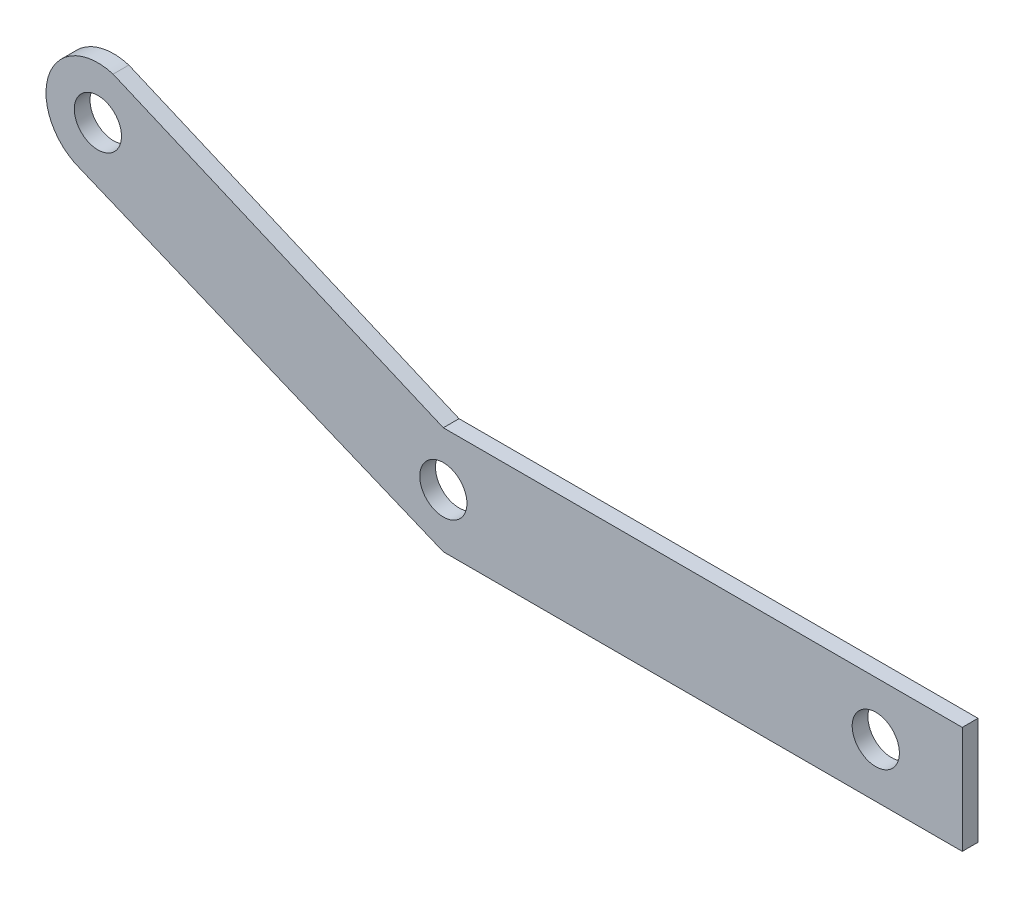
ISO-10303-21;
HEADER;
FILE_DESCRIPTION(('STEP AP214'),'2;1');
FILE_NAME('part.step','',(''),(''),'','','');
FILE_SCHEMA(('AUTOMOTIVE_DESIGN { 1 0 10303 214 1 1 1 1 }'));
ENDSEC;
DATA;
#1=APPLICATION_CONTEXT('core data for automotive mechanical design processes');
#2=APPLICATION_PROTOCOL_DEFINITION('international standard','automotive_design',2000,#1);
#3=PRODUCT_CONTEXT('',#1,'mechanical');
#4=PRODUCT('Part','Part','',(#3));
#5=PRODUCT_RELATED_PRODUCT_CATEGORY('part','',(#4));
#6=PRODUCT_DEFINITION_FORMATION('','',#4);
#7=PRODUCT_DEFINITION_CONTEXT('part definition',#1,'design');
#8=PRODUCT_DEFINITION('design','',#6,#7);
#9=PRODUCT_DEFINITION_SHAPE('','',#8);
#10=(LENGTH_UNIT() NAMED_UNIT(*) SI_UNIT(.MILLI.,.METRE.));
#11=(NAMED_UNIT(*) PLANE_ANGLE_UNIT() SI_UNIT($,.RADIAN.));
#12=(NAMED_UNIT(*) SI_UNIT($,.STERADIAN.) SOLID_ANGLE_UNIT());
#13=UNCERTAINTY_MEASURE_WITH_UNIT(LENGTH_MEASURE(1.E-05),#10,'distance_accuracy_value','');
#14=(GEOMETRIC_REPRESENTATION_CONTEXT(3) GLOBAL_UNCERTAINTY_ASSIGNED_CONTEXT((#13)) GLOBAL_UNIT_ASSIGNED_CONTEXT((#10,
#11,#12)) REPRESENTATION_CONTEXT('',''));
#15=CARTESIAN_POINT('',(0.,0.,0.));
#16=DIRECTION('',(0.,0.,1.));
#17=DIRECTION('',(1.,0.,0.));
#18=AXIS2_PLACEMENT_3D('',#15,#16,#17);
#19=CARTESIAN_POINT('',(-18.5532705911336,21.3794794147464,1.));
#20=DIRECTION('',(0.,0.,1.));
#21=DIRECTION('',(1.,0.,0.));
#22=AXIS2_PLACEMENT_3D('',#19,#20,#21);
#23=PLANE('',#22);
#24=CARTESIAN_POINT('',(3.41372940886644,12.1449794138697,1.));
#25=DIRECTION('',(0.,0.,1.));
#26=DIRECTION('',(1.,0.,0.));
#27=AXIS2_PLACEMENT_3D('',#24,#25,#26);
#28=CIRCLE('',#27,1.5);
#29=CARTESIAN_POINT('',(4.91372940886644,12.1449794138697,1.));
#30=VERTEX_POINT('',#29);
#31=EDGE_CURVE('E185',#30,#30,#28,.T.);
#32=ORIENTED_EDGE('',*,*,#31,.F.);
#33=EDGE_LOOP('',(#32));
#34=FACE_BOUND('',#33,.T.);
#35=DIRECTION('',(-1.,0.,0.));
#36=VECTOR('',#35,1.);
#37=CARTESIAN_POINT('',(36.4137294088664,15.5604794147463,1.));
#38=LINE('',#37,#36);
#39=CARTESIAN_POINT('',(36.4137294088664,15.5604794147463,1.));
#40=VERTEX_POINT('',#39);
#41=CARTESIAN_POINT('',(3.41372940886644,15.5604794147463,1.));
#42=VERTEX_POINT('',#41);
#43=EDGE_CURVE('E130',#40,#42,#38,.T.);
#44=ORIENTED_EDGE('',*,*,#43,.T.);
#45=DIRECTION('',(-0.919555921015903,0.392959168520845,0.));
#46=VECTOR('',#45,1.);
#47=CARTESIAN_POINT('',(3.41372940886644,15.5604794147463,1.));
#48=LINE('',#47,#46);
#49=CARTESIAN_POINT('',(-17.5870023894258,24.5348440152907,1.));
#50=VERTEX_POINT('',#49);
#51=EDGE_CURVE('E88',#42,#50,#48,.T.);
#52=ORIENTED_EDGE('',*,*,#51,.T.);
#53=CARTESIAN_POINT('',(-18.5532705911336,21.3794794147464,1.));
#54=DIRECTION('',(0.,0.,1.));
#55=DIRECTION('',(1.,0.,0.));
#56=AXIS2_PLACEMENT_3D('',#53,#54,#55);
#57=CIRCLE('',#56,3.3);
#58=CARTESIAN_POINT('',(-19.719697987445,18.2924991541788,1.));
#59=VERTEX_POINT('',#58);
#60=EDGE_CURVE('E101',#50,#59,#57,.T.);
#61=ORIENTED_EDGE('',*,*,#60,.T.);
#62=DIRECTION('',(0.924149912006193,-0.382030025179888,0.));
#63=VECTOR('',#62,1.);
#64=CARTESIAN_POINT('',(-19.719697987445,18.2924991541788,1.));
#65=LINE('',#64,#63);
#66=CARTESIAN_POINT('',(3.41372940886644,8.72947941474635,1.));
#67=VERTEX_POINT('',#66);
#68=EDGE_CURVE('E95',#59,#67,#65,.T.);
#69=ORIENTED_EDGE('',*,*,#68,.T.);
#70=DIRECTION('',(1.,0.,0.));
#71=VECTOR('',#70,1.);
#72=CARTESIAN_POINT('',(3.41372940886644,8.72947941474635,1.));
#73=LINE('',#72,#71);
#74=CARTESIAN_POINT('',(36.4137294088664,8.72947941474635,1.));
#75=VERTEX_POINT('',#74);
#76=EDGE_CURVE('E99',#67,#75,#73,.T.);
#77=ORIENTED_EDGE('',*,*,#76,.T.);
#78=DIRECTION('',(0.,1.,0.));
#79=VECTOR('',#78,1.);
#80=CARTESIAN_POINT('',(36.4137294088664,15.5604794147463,1.));
#81=LINE('',#80,#79);
#82=EDGE_CURVE('E51',#75,#40,#81,.T.);
#83=ORIENTED_EDGE('',*,*,#82,.T.);
#84=EDGE_LOOP('',(#44,#52,#61,#69,#77,#83));
#85=FACE_BOUND('',#84,.T.);
#86=CARTESIAN_POINT('',(30.9137294088664,12.1449794138697,1.));
#87=DIRECTION('',(0.,0.,1.));
#88=DIRECTION('',(1.,0.,0.));
#89=AXIS2_PLACEMENT_3D('',#86,#87,#88);
#90=CIRCLE('',#89,1.5);
#91=CARTESIAN_POINT('',(32.4137294088664,12.1449794138697,1.));
#92=VERTEX_POINT('',#91);
#93=EDGE_CURVE('E123',#92,#92,#90,.T.);
#94=ORIENTED_EDGE('',*,*,#93,.F.);
#95=EDGE_LOOP('',(#94));
#96=FACE_BOUND('',#95,.T.);
#97=CARTESIAN_POINT('',(-18.5532705911336,21.3794794147464,1.));
#98=DIRECTION('',(0.,0.,1.));
#99=DIRECTION('',(1.,0.,0.));
#100=AXIS2_PLACEMENT_3D('',#97,#98,#99);
#101=CIRCLE('',#100,1.5);
#102=CARTESIAN_POINT('',(-17.0532705911336,21.3794794147464,1.));
#103=VERTEX_POINT('',#102);
#104=EDGE_CURVE('E176',#103,#103,#101,.T.);
#105=ORIENTED_EDGE('',*,*,#104,.F.);
#106=EDGE_LOOP('',(#105));
#107=FACE_BOUND('',#106,.T.);
#108=ADVANCED_FACE('F34',(#34,#85,#96,#107),#23,.T.);
#109=CARTESIAN_POINT('',(-18.5532705911336,21.3794794147464,0.));
#110=DIRECTION('',(0.,0.,1.));
#111=DIRECTION('',(1.,0.,0.));
#112=AXIS2_PLACEMENT_3D('',#109,#110,#111);
#113=PLANE('',#112);
#114=DIRECTION('',(-1.,0.,0.));
#115=VECTOR('',#114,1.);
#116=CARTESIAN_POINT('',(36.4137294088664,15.5604794147463,0.));
#117=LINE('',#116,#115);
#118=CARTESIAN_POINT('',(36.4137294088664,15.5604794147463,0.));
#119=VERTEX_POINT('',#118);
#120=CARTESIAN_POINT('',(3.41372940886644,15.5604794147463,0.));
#121=VERTEX_POINT('',#120);
#122=EDGE_CURVE('E119',#119,#121,#117,.T.);
#123=ORIENTED_EDGE('',*,*,#122,.F.);
#124=DIRECTION('',(0.,1.,0.));
#125=VECTOR('',#124,1.);
#126=CARTESIAN_POINT('',(36.4137294088664,15.5604794147463,0.));
#127=LINE('',#126,#125);
#128=CARTESIAN_POINT('',(36.4137294088664,8.72947941474635,0.));
#129=VERTEX_POINT('',#128);
#130=EDGE_CURVE('E80',#129,#119,#127,.T.);
#131=ORIENTED_EDGE('',*,*,#130,.F.);
#132=DIRECTION('',(1.,0.,0.));
#133=VECTOR('',#132,1.);
#134=CARTESIAN_POINT('',(3.41372940886644,8.72947941474635,0.));
#135=LINE('',#134,#133);
#136=CARTESIAN_POINT('',(3.41372940886644,8.72947941474635,0.));
#137=VERTEX_POINT('',#136);
#138=EDGE_CURVE('E74',#137,#129,#135,.T.);
#139=ORIENTED_EDGE('',*,*,#138,.F.);
#140=DIRECTION('',(0.924149912006193,-0.382030025179888,0.));
#141=VECTOR('',#140,1.);
#142=CARTESIAN_POINT('',(-19.719697987445,18.2924991541788,0.));
#143=LINE('',#142,#141);
#144=CARTESIAN_POINT('',(-19.719697987445,18.2924991541788,0.));
#145=VERTEX_POINT('',#144);
#146=EDGE_CURVE('E109',#145,#137,#143,.T.);
#147=ORIENTED_EDGE('',*,*,#146,.F.);
#148=CARTESIAN_POINT('',(-18.5532705911336,21.3794794147464,0.));
#149=DIRECTION('',(0.,0.,1.));
#150=DIRECTION('',(1.,0.,0.));
#151=AXIS2_PLACEMENT_3D('',#148,#149,#150);
#152=CIRCLE('',#151,3.3);
#153=CARTESIAN_POINT('',(-17.5870023894258,24.5348440152907,0.));
#154=VERTEX_POINT('',#153);
#155=EDGE_CURVE('E125',#154,#145,#152,.T.);
#156=ORIENTED_EDGE('',*,*,#155,.F.);
#157=DIRECTION('',(-0.919555921015903,0.392959168520845,0.));
#158=VECTOR('',#157,1.);
#159=CARTESIAN_POINT('',(3.41372940886644,15.5604794147463,0.));
#160=LINE('',#159,#158);
#161=EDGE_CURVE('E122',#121,#154,#160,.T.);
#162=ORIENTED_EDGE('',*,*,#161,.F.);
#163=EDGE_LOOP('',(#123,#131,#139,#147,#156,#162));
#164=FACE_BOUND('',#163,.T.);
#165=CARTESIAN_POINT('',(30.9137294088664,12.1449794138697,0.));
#166=DIRECTION('',(0.,0.,1.));
#167=DIRECTION('',(1.,0.,0.));
#168=AXIS2_PLACEMENT_3D('',#165,#166,#167);
#169=CIRCLE('',#168,1.5);
#170=CARTESIAN_POINT('',(32.4137294088664,12.1449794138697,0.));
#171=VERTEX_POINT('',#170);
#172=EDGE_CURVE('E188',#171,#171,#169,.T.);
#173=ORIENTED_EDGE('',*,*,#172,.T.);
#174=EDGE_LOOP('',(#173));
#175=FACE_BOUND('',#174,.T.);
#176=CARTESIAN_POINT('',(3.41372940886644,12.1449794138697,0.));
#177=DIRECTION('',(0.,0.,1.));
#178=DIRECTION('',(1.,0.,0.));
#179=AXIS2_PLACEMENT_3D('',#176,#177,#178);
#180=CIRCLE('',#179,1.5);
#181=CARTESIAN_POINT('',(4.91372940886644,12.1449794138697,0.));
#182=VERTEX_POINT('',#181);
#183=EDGE_CURVE('E182',#182,#182,#180,.T.);
#184=ORIENTED_EDGE('',*,*,#183,.T.);
#185=EDGE_LOOP('',(#184));
#186=FACE_BOUND('',#185,.T.);
#187=CARTESIAN_POINT('',(-18.5532705911336,21.3794794147464,0.));
#188=DIRECTION('',(0.,0.,1.));
#189=DIRECTION('',(1.,0.,0.));
#190=AXIS2_PLACEMENT_3D('',#187,#188,#189);
#191=CIRCLE('',#190,1.5);
#192=CARTESIAN_POINT('',(-17.0532705911336,21.3794794147464,0.));
#193=VERTEX_POINT('',#192);
#194=EDGE_CURVE('E179',#193,#193,#191,.T.);
#195=ORIENTED_EDGE('',*,*,#194,.T.);
#196=EDGE_LOOP('',(#195));
#197=FACE_BOUND('',#196,.T.);
#198=ADVANCED_FACE('F139',(#164,#175,#186,#197),#113,.F.);
#199=CARTESIAN_POINT('',(36.4137294088664,15.5604794147463,1.));
#200=DIRECTION('',(0.,-1.,0.));
#201=DIRECTION('',(0.,0.,-1.));
#202=AXIS2_PLACEMENT_3D('',#199,#200,#201);
#203=PLANE('',#202);
#204=ORIENTED_EDGE('',*,*,#122,.T.);
#205=DIRECTION('',(0.,0.,-1.));
#206=VECTOR('',#205,1.);
#207=CARTESIAN_POINT('',(3.41372940886644,15.5604794147463,1.));
#208=LINE('',#207,#206);
#209=EDGE_CURVE('E11',#42,#121,#208,.T.);
#210=ORIENTED_EDGE('',*,*,#209,.F.);
#211=ORIENTED_EDGE('',*,*,#43,.F.);
#212=DIRECTION('',(0.,0.,-1.));
#213=VECTOR('',#212,1.);
#214=CARTESIAN_POINT('',(36.4137294088664,15.5604794147463,1.));
#215=LINE('',#214,#213);
#216=EDGE_CURVE('E115',#40,#119,#215,.T.);
#217=ORIENTED_EDGE('',*,*,#216,.T.);
#218=EDGE_LOOP('',(#204,#210,#211,#217));
#219=FACE_BOUND('',#218,.T.);
#220=ADVANCED_FACE('F36',(#219),#203,.F.);
#221=CARTESIAN_POINT('',(3.41372940886644,15.5604794147463,1.));
#222=DIRECTION('',(-0.392959168520845,-0.919555921015903,0.));
#223=DIRECTION('',(0.919555921015903,-0.392959168520845,0.));
#224=AXIS2_PLACEMENT_3D('',#221,#222,#223);
#225=PLANE('',#224);
#226=ORIENTED_EDGE('',*,*,#161,.T.);
#227=DIRECTION('',(0.,0.,-1.));
#228=VECTOR('',#227,1.);
#229=CARTESIAN_POINT('',(-17.5870023894258,24.5348440152907,1.));
#230=LINE('',#229,#228);
#231=EDGE_CURVE('E43',#50,#154,#230,.T.);
#232=ORIENTED_EDGE('',*,*,#231,.F.);
#233=ORIENTED_EDGE('',*,*,#51,.F.);
#234=ORIENTED_EDGE('',*,*,#209,.T.);
#235=EDGE_LOOP('',(#226,#232,#233,#234));
#236=FACE_BOUND('',#235,.T.);
#237=ADVANCED_FACE('F238',(#236),#225,.F.);
#238=CARTESIAN_POINT('',(-18.5532705911336,21.3794794147464,1.));
#239=DIRECTION('',(0.,0.,-1.));
#240=DIRECTION('',(-1.,0.,0.));
#241=AXIS2_PLACEMENT_3D('',#238,#239,#240);
#242=CYLINDRICAL_SURFACE('',#241,3.3);
#243=ORIENTED_EDGE('',*,*,#155,.T.);
#244=DIRECTION('',(0.,0.,-1.));
#245=VECTOR('',#244,1.);
#246=CARTESIAN_POINT('',(-19.719697987445,18.2924991541788,1.));
#247=LINE('',#246,#245);
#248=EDGE_CURVE('E110',#59,#145,#247,.T.);
#249=ORIENTED_EDGE('',*,*,#248,.F.);
#250=ORIENTED_EDGE('',*,*,#60,.F.);
#251=ORIENTED_EDGE('',*,*,#231,.T.);
#252=EDGE_LOOP('',(#243,#249,#250,#251));
#253=FACE_BOUND('',#252,.T.);
#254=ADVANCED_FACE('F136',(#253),#242,.T.);
#255=CARTESIAN_POINT('',(-19.719697987445,18.2924991541788,1.));
#256=DIRECTION('',(0.382030025179888,0.924149912006193,0.));
#257=DIRECTION('',(-0.924149912006193,0.382030025179888,0.));
#258=AXIS2_PLACEMENT_3D('',#255,#256,#257);
#259=PLANE('',#258);
#260=ORIENTED_EDGE('',*,*,#146,.T.);
#261=DIRECTION('',(0.,0.,-1.));
#262=VECTOR('',#261,1.);
#263=CARTESIAN_POINT('',(3.41372940886644,8.72947941474635,1.));
#264=LINE('',#263,#262);
#265=EDGE_CURVE('E106',#67,#137,#264,.T.);
#266=ORIENTED_EDGE('',*,*,#265,.F.);
#267=ORIENTED_EDGE('',*,*,#68,.F.);
#268=ORIENTED_EDGE('',*,*,#248,.T.);
#269=EDGE_LOOP('',(#260,#266,#267,#268));
#270=FACE_BOUND('',#269,.T.);
#271=ADVANCED_FACE('F107',(#270),#259,.F.);
#272=CARTESIAN_POINT('',(3.41372940886644,8.72947941474635,1.));
#273=DIRECTION('',(0.,1.,0.));
#274=DIRECTION('',(0.,0.,1.));
#275=AXIS2_PLACEMENT_3D('',#272,#273,#274);
#276=PLANE('',#275);
#277=ORIENTED_EDGE('',*,*,#138,.T.);
#278=DIRECTION('',(0.,0.,-1.));
#279=VECTOR('',#278,1.);
#280=CARTESIAN_POINT('',(36.4137294088664,8.72947941474635,1.));
#281=LINE('',#280,#279);
#282=EDGE_CURVE('E111',#75,#129,#281,.T.);
#283=ORIENTED_EDGE('',*,*,#282,.F.);
#284=ORIENTED_EDGE('',*,*,#76,.F.);
#285=ORIENTED_EDGE('',*,*,#265,.T.);
#286=EDGE_LOOP('',(#277,#283,#284,#285));
#287=FACE_BOUND('',#286,.T.);
#288=ADVANCED_FACE('F113',(#287),#276,.F.);
#289=CARTESIAN_POINT('',(36.4137294088664,15.5604794147463,1.));
#290=DIRECTION('',(-1.,0.,0.));
#291=DIRECTION('',(0.,0.,1.));
#292=AXIS2_PLACEMENT_3D('',#289,#290,#291);
#293=PLANE('',#292);
#294=ORIENTED_EDGE('',*,*,#130,.T.);
#295=ORIENTED_EDGE('',*,*,#216,.F.);
#296=ORIENTED_EDGE('',*,*,#82,.F.);
#297=ORIENTED_EDGE('',*,*,#282,.T.);
#298=EDGE_LOOP('',(#294,#295,#296,#297));
#299=FACE_BOUND('',#298,.T.);
#300=ADVANCED_FACE('F144',(#299),#293,.F.);
#301=CARTESIAN_POINT('',(30.9137294088664,12.1449794138697,1.));
#302=DIRECTION('',(0.,0.,-1.));
#303=DIRECTION('',(-1.,0.,0.));
#304=AXIS2_PLACEMENT_3D('',#301,#302,#303);
#305=CYLINDRICAL_SURFACE('',#304,1.5);
#306=ORIENTED_EDGE('',*,*,#93,.T.);
#307=EDGE_LOOP('',(#306));
#308=FACE_BOUND('',#307,.T.);
#309=ORIENTED_EDGE('',*,*,#172,.F.);
#310=EDGE_LOOP('',(#309));
#311=FACE_BOUND('',#310,.T.);
#312=ADVANCED_FACE('F146',(#308,#311),#305,.F.);
#313=CARTESIAN_POINT('',(3.41372940886644,12.1449794138697,1.));
#314=DIRECTION('',(0.,0.,-1.));
#315=DIRECTION('',(-1.,0.,0.));
#316=AXIS2_PLACEMENT_3D('',#313,#314,#315);
#317=CYLINDRICAL_SURFACE('',#316,1.5);
#318=ORIENTED_EDGE('',*,*,#31,.T.);
#319=EDGE_LOOP('',(#318));
#320=FACE_BOUND('',#319,.T.);
#321=ORIENTED_EDGE('',*,*,#183,.F.);
#322=EDGE_LOOP('',(#321));
#323=FACE_BOUND('',#322,.T.);
#324=ADVANCED_FACE('F152',(#320,#323),#317,.F.);
#325=CARTESIAN_POINT('',(-18.5532705911336,21.3794794147464,1.));
#326=DIRECTION('',(0.,0.,-1.));
#327=DIRECTION('',(-1.,0.,0.));
#328=AXIS2_PLACEMENT_3D('',#325,#326,#327);
#329=CYLINDRICAL_SURFACE('',#328,1.5);
#330=ORIENTED_EDGE('',*,*,#104,.T.);
#331=EDGE_LOOP('',(#330));
#332=FACE_BOUND('',#331,.T.);
#333=ORIENTED_EDGE('',*,*,#194,.F.);
#334=EDGE_LOOP('',(#333));
#335=FACE_BOUND('',#334,.T.);
#336=ADVANCED_FACE('F167',(#332,#335),#329,.F.);
#337=CLOSED_SHELL('',(#108,#198,#220,#237,#254,#271,#288,#300,#312,#324,#336));
#338=MANIFOLD_SOLID_BREP('B2',#337);
#339=ADVANCED_BREP_SHAPE_REPRESENTATION('',(#18,#338),#14);
#340=SHAPE_DEFINITION_REPRESENTATION(#9,#339);
ENDSEC;
END-ISO-10303-21;
